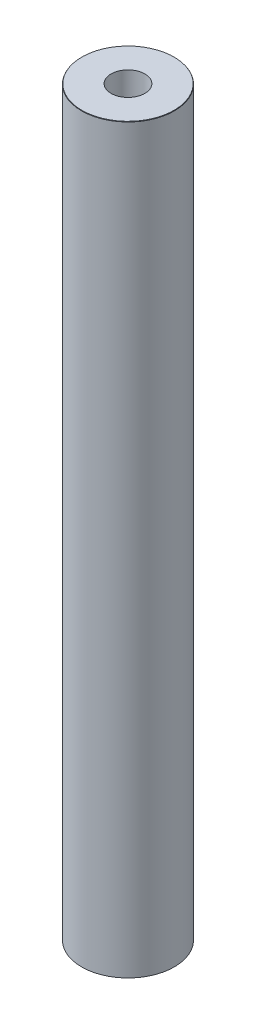
ISO-10303-21;
HEADER;
FILE_DESCRIPTION(('STEP AP214'),'2;1');
FILE_NAME('part.step','',(''),(''),'','','');
FILE_SCHEMA(('AUTOMOTIVE_DESIGN { 1 0 10303 214 1 1 1 1 }'));
ENDSEC;
DATA;
#1=APPLICATION_CONTEXT('core data for automotive mechanical design processes');
#2=APPLICATION_PROTOCOL_DEFINITION('international standard','automotive_design',2000,#1);
#3=PRODUCT_CONTEXT('',#1,'mechanical');
#4=PRODUCT('Part','Part','',(#3));
#5=PRODUCT_RELATED_PRODUCT_CATEGORY('part','',(#4));
#6=PRODUCT_DEFINITION_FORMATION('','',#4);
#7=PRODUCT_DEFINITION_CONTEXT('part definition',#1,'design');
#8=PRODUCT_DEFINITION('design','',#6,#7);
#9=PRODUCT_DEFINITION_SHAPE('','',#8);
#10=(LENGTH_UNIT() NAMED_UNIT(*) SI_UNIT(.MILLI.,.METRE.));
#11=(NAMED_UNIT(*) PLANE_ANGLE_UNIT() SI_UNIT($,.RADIAN.));
#12=(NAMED_UNIT(*) SI_UNIT($,.STERADIAN.) SOLID_ANGLE_UNIT());
#13=UNCERTAINTY_MEASURE_WITH_UNIT(LENGTH_MEASURE(1.E-05),#10,'distance_accuracy_value','');
#14=(GEOMETRIC_REPRESENTATION_CONTEXT(3) GLOBAL_UNCERTAINTY_ASSIGNED_CONTEXT((#13)) GLOBAL_UNIT_ASSIGNED_CONTEXT((#10,
#11,#12)) REPRESENTATION_CONTEXT('',''));
#15=CARTESIAN_POINT('',(0.,0.,0.));
#16=DIRECTION('',(0.,0.,1.));
#17=DIRECTION('',(1.,0.,0.));
#18=AXIS2_PLACEMENT_3D('',#15,#16,#17);
#19=CARTESIAN_POINT('',(0.,600.,0.));
#20=DIRECTION('',(0.,-1.,0.));
#21=DIRECTION('',(0.,0.,-1.));
#22=AXIS2_PLACEMENT_3D('',#19,#20,#21);
#23=CYLINDRICAL_SURFACE('',#22,37.5);
#24=CARTESIAN_POINT('',(0.,599.660794954637,0.));
#25=DIRECTION('',(0.,1.,0.));
#26=DIRECTION('',(0.,0.,1.));
#27=AXIS2_PLACEMENT_3D('',#24,#25,#26);
#28=CIRCLE('',#27,37.5);
#29=CARTESIAN_POINT('',(0.,599.660794954637,37.5));
#30=VERTEX_POINT('',#29);
#31=EDGE_CURVE('E50',#30,#30,#28,.F.);
#32=ORIENTED_EDGE('',*,*,#31,.T.);
#33=EDGE_LOOP('',(#32));
#34=FACE_BOUND('',#33,.T.);
#35=CARTESIAN_POINT('',(0.,0.195840124250668,0.));
#36=DIRECTION('',(0.,1.,0.));
#37=DIRECTION('',(0.,0.,1.));
#38=AXIS2_PLACEMENT_3D('',#35,#36,#37);
#39=CIRCLE('',#38,37.5);
#40=CARTESIAN_POINT('',(0.,0.195840124250668,37.5));
#41=VERTEX_POINT('',#40);
#42=EDGE_CURVE('E51',#41,#41,#39,.T.);
#43=ORIENTED_EDGE('',*,*,#42,.T.);
#44=EDGE_LOOP('',(#43));
#45=FACE_BOUND('',#44,.T.);
#46=ADVANCED_FACE('F39',(#34,#45),#23,.T.);
#47=CARTESIAN_POINT('',(0.,600.,0.));
#48=DIRECTION('',(0.,1.,0.));
#49=DIRECTION('',(0.,0.,1.));
#50=AXIS2_PLACEMENT_3D('',#47,#48,#49);
#51=PLANE('',#50);
#52=CARTESIAN_POINT('',(0.,600.,0.));
#53=DIRECTION('',(0.,1.,0.));
#54=DIRECTION('',(0.,0.,1.));
#55=AXIS2_PLACEMENT_3D('',#52,#53,#54);
#56=CIRCLE('',#55,37.3041598757493);
#57=CARTESIAN_POINT('',(0.,600.,37.3041598757493));
#58=VERTEX_POINT('',#57);
#59=EDGE_CURVE('E54',#58,#58,#56,.T.);
#60=ORIENTED_EDGE('',*,*,#59,.T.);
#61=EDGE_LOOP('',(#60));
#62=FACE_BOUND('',#61,.T.);
#63=CARTESIAN_POINT('',(0.,600.,0.));
#64=DIRECTION('',(0.,1.,0.));
#65=DIRECTION('',(0.,0.,1.));
#66=AXIS2_PLACEMENT_3D('',#63,#64,#65);
#67=CIRCLE('',#66,13.6710860634281);
#68=CARTESIAN_POINT('',(0.,600.,13.6710860634281));
#69=VERTEX_POINT('',#68);
#70=EDGE_CURVE('E58',#69,#69,#67,.T.);
#71=ORIENTED_EDGE('',*,*,#70,.F.);
#72=EDGE_LOOP('',(#71));
#73=FACE_BOUND('',#72,.T.);
#74=ADVANCED_FACE('F69',(#62,#73),#51,.T.);
#75=CARTESIAN_POINT('',(0.,0.,0.));
#76=DIRECTION('',(0.,1.,0.));
#77=DIRECTION('',(0.,0.,1.));
#78=AXIS2_PLACEMENT_3D('',#75,#76,#77);
#79=PLANE('',#78);
#80=CARTESIAN_POINT('',(0.,0.,0.));
#81=DIRECTION('',(0.,1.,0.));
#82=DIRECTION('',(0.,0.,1.));
#83=AXIS2_PLACEMENT_3D('',#80,#81,#82);
#84=CIRCLE('',#83,37.1607949546374);
#85=CARTESIAN_POINT('',(0.,0.,37.1607949546374));
#86=VERTEX_POINT('',#85);
#87=EDGE_CURVE('E10',#86,#86,#84,.F.);
#88=ORIENTED_EDGE('',*,*,#87,.T.);
#89=EDGE_LOOP('',(#88));
#90=FACE_BOUND('',#89,.T.);
#91=CARTESIAN_POINT('',(0.,0.,0.));
#92=DIRECTION('',(0.,1.,0.));
#93=DIRECTION('',(0.,0.,1.));
#94=AXIS2_PLACEMENT_3D('',#91,#92,#93);
#95=CIRCLE('',#94,13.6710860634281);
#96=CARTESIAN_POINT('',(0.,0.,13.6710860634281));
#97=VERTEX_POINT('',#96);
#98=EDGE_CURVE('E63',#97,#97,#95,.T.);
#99=ORIENTED_EDGE('',*,*,#98,.T.);
#100=EDGE_LOOP('',(#99));
#101=FACE_BOUND('',#100,.T.);
#102=ADVANCED_FACE('F75',(#90,#101),#79,.F.);
#103=CARTESIAN_POINT('',(0.,600.,0.));
#104=DIRECTION('',(0.,-1.,0.));
#105=DIRECTION('',(0.,0.,-1.));
#106=AXIS2_PLACEMENT_3D('',#103,#104,#105);
#107=CYLINDRICAL_SURFACE('',#106,13.6710860634281);
#108=ORIENTED_EDGE('',*,*,#70,.T.);
#109=EDGE_LOOP('',(#108));
#110=FACE_BOUND('',#109,.T.);
#111=ORIENTED_EDGE('',*,*,#98,.F.);
#112=EDGE_LOOP('',(#111));
#113=FACE_BOUND('',#112,.T.);
#114=ADVANCED_FACE('F70',(#110,#113),#107,.F.);
#115=CARTESIAN_POINT('',(0.,600.,0.));
#116=DIRECTION('',(0.,-1.,0.));
#117=DIRECTION('',(0.,0.,-1.));
#118=AXIS2_PLACEMENT_3D('',#115,#116,#117);
#119=CONICAL_SURFACE('',#118,37.3041598757493,0.523598775598335);
#120=ORIENTED_EDGE('',*,*,#31,.F.);
#121=EDGE_LOOP('',(#120));
#122=FACE_BOUND('',#121,.T.);
#123=ORIENTED_EDGE('',*,*,#59,.F.);
#124=EDGE_LOOP('',(#123));
#125=FACE_BOUND('',#124,.T.);
#126=ADVANCED_FACE('F81',(#122,#125),#119,.T.);
#127=CARTESIAN_POINT('',(0.,0.195840124250668,0.));
#128=DIRECTION('',(0.,1.,0.));
#129=DIRECTION('',(0.,0.,1.));
#130=AXIS2_PLACEMENT_3D('',#127,#128,#129);
#131=CONICAL_SURFACE('',#130,37.5,1.04719755119637);
#132=ORIENTED_EDGE('',*,*,#87,.F.);
#133=EDGE_LOOP('',(#132));
#134=FACE_BOUND('',#133,.T.);
#135=ORIENTED_EDGE('',*,*,#42,.F.);
#136=EDGE_LOOP('',(#135));
#137=FACE_BOUND('',#136,.T.);
#138=ADVANCED_FACE('F45',(#134,#137),#131,.T.);
#139=CLOSED_SHELL('',(#46,#74,#102,#114,#126,#138));
#140=MANIFOLD_SOLID_BREP('B2',#139);
#141=ADVANCED_BREP_SHAPE_REPRESENTATION('',(#18,#140),#14);
#142=SHAPE_DEFINITION_REPRESENTATION(#9,#141);
ENDSEC;
END-ISO-10303-21;
